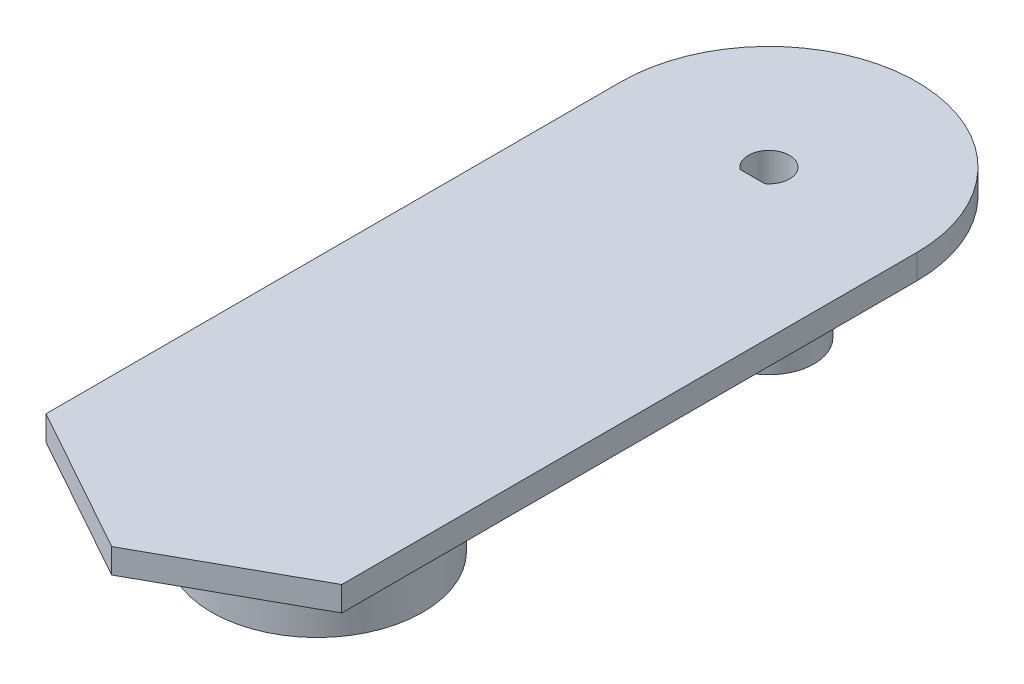
ISO-10303-21;
HEADER;
FILE_DESCRIPTION(('STEP AP214'),'2;1');
FILE_NAME('part.step','',(''),(''),'','','');
FILE_SCHEMA(('AUTOMOTIVE_DESIGN { 1 0 10303 214 1 1 1 1 }'));
ENDSEC;
DATA;
#1=APPLICATION_CONTEXT('core data for automotive mechanical design processes');
#2=APPLICATION_PROTOCOL_DEFINITION('international standard','automotive_design',2000,#1);
#3=PRODUCT_CONTEXT('',#1,'mechanical');
#4=PRODUCT('Part','Part','',(#3));
#5=PRODUCT_RELATED_PRODUCT_CATEGORY('part','',(#4));
#6=PRODUCT_DEFINITION_FORMATION('','',#4);
#7=PRODUCT_DEFINITION_CONTEXT('part definition',#1,'design');
#8=PRODUCT_DEFINITION('design','',#6,#7);
#9=PRODUCT_DEFINITION_SHAPE('','',#8);
#10=(LENGTH_UNIT() NAMED_UNIT(*) SI_UNIT(.MILLI.,.METRE.));
#11=(NAMED_UNIT(*) PLANE_ANGLE_UNIT() SI_UNIT($,.RADIAN.));
#12=(NAMED_UNIT(*) SI_UNIT($,.STERADIAN.) SOLID_ANGLE_UNIT());
#13=UNCERTAINTY_MEASURE_WITH_UNIT(LENGTH_MEASURE(1.E-05),#10,'distance_accuracy_value','');
#14=(GEOMETRIC_REPRESENTATION_CONTEXT(3) GLOBAL_UNCERTAINTY_ASSIGNED_CONTEXT((#13)) GLOBAL_UNIT_ASSIGNED_CONTEXT((#10,
#11,#12)) REPRESENTATION_CONTEXT('',''));
#15=CARTESIAN_POINT('',(0.,0.,0.));
#16=DIRECTION('',(0.,0.,1.));
#17=DIRECTION('',(1.,0.,0.));
#18=AXIS2_PLACEMENT_3D('',#15,#16,#17);
#19=CARTESIAN_POINT('',(2.5,15.,-2.5));
#20=DIRECTION('',(0.,-1.,0.));
#21=DIRECTION('',(0.,0.,-1.));
#22=AXIS2_PLACEMENT_3D('',#19,#20,#21);
#23=CYLINDRICAL_SURFACE('',#22,2.5);
#24=CARTESIAN_POINT('',(2.5,0.,-2.5));
#25=DIRECTION('',(0.,1.,0.));
#26=DIRECTION('',(0.,0.,1.));
#27=AXIS2_PLACEMENT_3D('',#24,#25,#26);
#28=CIRCLE('',#27,2.5);
#29=CARTESIAN_POINT('',(4.,0.,-0.5));
#30=VERTEX_POINT('',#29);
#31=CARTESIAN_POINT('',(0.999999999999999,0.,-0.5));
#32=VERTEX_POINT('',#31);
#33=EDGE_CURVE('E102',#30,#32,#28,.T.);
#34=ORIENTED_EDGE('',*,*,#33,.F.);
#35=DIRECTION('',(0.,-1.,0.));
#36=VECTOR('',#35,1.);
#37=CARTESIAN_POINT('',(4.,15.,-0.5));
#38=LINE('',#37,#36);
#39=CARTESIAN_POINT('',(4.,18.,-0.5));
#40=VERTEX_POINT('',#39);
#41=EDGE_CURVE('E42',#40,#30,#38,.T.);
#42=ORIENTED_EDGE('',*,*,#41,.F.);
#43=CARTESIAN_POINT('',(2.5,18.,-2.5));
#44=DIRECTION('',(0.,1.,0.));
#45=DIRECTION('',(0.,0.,1.));
#46=AXIS2_PLACEMENT_3D('',#43,#44,#45);
#47=CIRCLE('',#46,2.5);
#48=CARTESIAN_POINT('',(0.999999999999999,18.,-0.5));
#49=VERTEX_POINT('',#48);
#50=EDGE_CURVE('E134',#49,#40,#47,.F.);
#51=ORIENTED_EDGE('',*,*,#50,.F.);
#52=DIRECTION('',(0.,-1.,0.));
#53=VECTOR('',#52,1.);
#54=CARTESIAN_POINT('',(0.999999999999999,15.,-0.5));
#55=LINE('',#54,#53);
#56=EDGE_CURVE('E49',#49,#32,#55,.T.);
#57=ORIENTED_EDGE('',*,*,#56,.T.);
#58=EDGE_LOOP('',(#34,#42,#51,#57));
#59=FACE_BOUND('',#58,.T.);
#60=ADVANCED_FACE('F35',(#59),#23,.F.);
#61=CARTESIAN_POINT('',(0.,15.,-0.5));
#62=DIRECTION('',(0.,0.,-1.));
#63=DIRECTION('',(-1.,0.,0.));
#64=AXIS2_PLACEMENT_3D('',#61,#62,#63);
#65=PLANE('',#64);
#66=DIRECTION('',(1.,0.,0.));
#67=VECTOR('',#66,1.);
#68=CARTESIAN_POINT('',(0.,0.,-0.5));
#69=LINE('',#68,#67);
#70=EDGE_CURVE('E157',#32,#30,#69,.T.);
#71=ORIENTED_EDGE('',*,*,#70,.F.);
#72=ORIENTED_EDGE('',*,*,#56,.F.);
#73=DIRECTION('',(-1.,0.,0.));
#74=VECTOR('',#73,1.);
#75=CARTESIAN_POINT('',(0.,18.,-0.5));
#76=LINE('',#75,#74);
#77=EDGE_CURVE('E131',#40,#49,#76,.T.);
#78=ORIENTED_EDGE('',*,*,#77,.F.);
#79=ORIENTED_EDGE('',*,*,#41,.T.);
#80=EDGE_LOOP('',(#71,#72,#78,#79));
#81=FACE_BOUND('',#80,.T.);
#82=ADVANCED_FACE('F175',(#81),#65,.T.);
#83=CARTESIAN_POINT('',(2.5,15.,-2.5));
#84=DIRECTION('',(0.,-1.,0.));
#85=DIRECTION('',(0.,0.,-1.));
#86=AXIS2_PLACEMENT_3D('',#83,#84,#85);
#87=CYLINDRICAL_SURFACE('',#86,5.5);
#88=CARTESIAN_POINT('',(2.5,15.,-2.5));
#89=DIRECTION('',(0.,1.,0.));
#90=DIRECTION('',(0.,0.,1.));
#91=AXIS2_PLACEMENT_3D('',#88,#89,#90);
#92=CIRCLE('',#91,5.5);
#93=CARTESIAN_POINT('',(2.5,15.,3.));
#94=VERTEX_POINT('',#93);
#95=EDGE_CURVE('E152',#94,#94,#92,.T.);
#96=ORIENTED_EDGE('',*,*,#95,.F.);
#97=EDGE_LOOP('',(#96));
#98=FACE_BOUND('',#97,.T.);
#99=CARTESIAN_POINT('',(2.5,0.,-2.5));
#100=DIRECTION('',(0.,1.,0.));
#101=DIRECTION('',(0.,0.,1.));
#102=AXIS2_PLACEMENT_3D('',#99,#100,#101);
#103=CIRCLE('',#102,5.5);
#104=CARTESIAN_POINT('',(2.5,0.,3.));
#105=VERTEX_POINT('',#104);
#106=EDGE_CURVE('E155',#105,#105,#103,.T.);
#107=ORIENTED_EDGE('',*,*,#106,.T.);
#108=EDGE_LOOP('',(#107));
#109=FACE_BOUND('',#108,.T.);
#110=ADVANCED_FACE('F164',(#98,#109),#87,.T.);
#111=CARTESIAN_POINT('',(0.,0.,0.));
#112=DIRECTION('',(0.,1.,0.));
#113=DIRECTION('',(0.,0.,1.));
#114=AXIS2_PLACEMENT_3D('',#111,#112,#113);
#115=PLANE('',#114);
#116=ORIENTED_EDGE('',*,*,#33,.T.);
#117=ORIENTED_EDGE('',*,*,#70,.T.);
#118=EDGE_LOOP('',(#116,#117));
#119=FACE_BOUND('',#118,.T.);
#120=ORIENTED_EDGE('',*,*,#106,.F.);
#121=EDGE_LOOP('',(#120));
#122=FACE_BOUND('',#121,.T.);
#123=ADVANCED_FACE('F166',(#119,#122),#115,.F.);
#124=CARTESIAN_POINT('',(20.5,18.,0.));
#125=DIRECTION('',(1.,0.,0.));
#126=DIRECTION('',(0.,0.,-1.));
#127=AXIS2_PLACEMENT_3D('',#124,#125,#126);
#128=PLANE('',#127);
#129=DIRECTION('',(0.,0.,1.));
#130=VECTOR('',#129,1.);
#131=CARTESIAN_POINT('',(20.5,15.,0.));
#132=LINE('',#131,#130);
#133=CARTESIAN_POINT('',(20.5,15.,-2.5));
#134=VERTEX_POINT('',#133);
#135=CARTESIAN_POINT('',(20.5,15.,67.5));
#136=VERTEX_POINT('',#135);
#137=EDGE_CURVE('E99',#134,#136,#132,.T.);
#138=ORIENTED_EDGE('',*,*,#137,.F.);
#139=DIRECTION('',(0.,-1.,0.));
#140=VECTOR('',#139,1.);
#141=CARTESIAN_POINT('',(20.5,18.,-2.5));
#142=LINE('',#141,#140);
#143=CARTESIAN_POINT('',(20.5,18.,-2.5));
#144=VERTEX_POINT('',#143);
#145=EDGE_CURVE('E93',#144,#134,#142,.T.);
#146=ORIENTED_EDGE('',*,*,#145,.F.);
#147=DIRECTION('',(0.,0.,1.));
#148=VECTOR('',#147,1.);
#149=CARTESIAN_POINT('',(20.5,18.,0.));
#150=LINE('',#149,#148);
#151=CARTESIAN_POINT('',(20.5,18.,67.5));
#152=VERTEX_POINT('',#151);
#153=EDGE_CURVE('E97',#144,#152,#150,.T.);
#154=ORIENTED_EDGE('',*,*,#153,.T.);
#155=DIRECTION('',(0.,-1.,0.));
#156=VECTOR('',#155,1.);
#157=CARTESIAN_POINT('',(20.5,18.,67.5));
#158=LINE('',#157,#156);
#159=EDGE_CURVE('E137',#152,#136,#158,.T.);
#160=ORIENTED_EDGE('',*,*,#159,.T.);
#161=EDGE_LOOP('',(#138,#146,#154,#160));
#162=FACE_BOUND('',#161,.T.);
#163=ADVANCED_FACE('F95',(#162),#128,.T.);
#164=CARTESIAN_POINT('',(2.5,18.,-2.5));
#165=DIRECTION('',(0.,-1.,0.));
#166=DIRECTION('',(0.,0.,-1.));
#167=AXIS2_PLACEMENT_3D('',#164,#165,#166);
#168=CYLINDRICAL_SURFACE('',#167,18.);
#169=CARTESIAN_POINT('',(2.5,15.,-2.5));
#170=DIRECTION('',(0.,1.,0.));
#171=DIRECTION('',(0.,0.,1.));
#172=AXIS2_PLACEMENT_3D('',#169,#170,#171);
#173=CIRCLE('',#172,18.);
#174=CARTESIAN_POINT('',(-15.5,15.,-2.5));
#175=VERTEX_POINT('',#174);
#176=EDGE_CURVE('E139',#134,#175,#173,.T.);
#177=ORIENTED_EDGE('',*,*,#176,.T.);
#178=DIRECTION('',(0.,-1.,0.));
#179=VECTOR('',#178,1.);
#180=CARTESIAN_POINT('',(-15.5,18.,-2.5));
#181=LINE('',#180,#179);
#182=CARTESIAN_POINT('',(-15.5,18.,-2.5));
#183=VERTEX_POINT('',#182);
#184=EDGE_CURVE('E103',#183,#175,#181,.T.);
#185=ORIENTED_EDGE('',*,*,#184,.F.);
#186=CARTESIAN_POINT('',(2.5,18.,-2.5));
#187=DIRECTION('',(0.,1.,0.));
#188=DIRECTION('',(0.,0.,1.));
#189=AXIS2_PLACEMENT_3D('',#186,#187,#188);
#190=CIRCLE('',#189,18.);
#191=EDGE_CURVE('E106',#144,#183,#190,.T.);
#192=ORIENTED_EDGE('',*,*,#191,.F.);
#193=ORIENTED_EDGE('',*,*,#145,.T.);
#194=EDGE_LOOP('',(#177,#185,#192,#193));
#195=FACE_BOUND('',#194,.T.);
#196=ADVANCED_FACE('F107',(#195),#168,.T.);
#197=CARTESIAN_POINT('',(-15.5,18.,0.));
#198=DIRECTION('',(1.,0.,0.));
#199=DIRECTION('',(0.,0.,-1.));
#200=AXIS2_PLACEMENT_3D('',#197,#198,#199);
#201=PLANE('',#200);
#202=DIRECTION('',(0.,0.,1.));
#203=VECTOR('',#202,1.);
#204=CARTESIAN_POINT('',(-15.5,15.,0.));
#205=LINE('',#204,#203);
#206=CARTESIAN_POINT('',(-15.5,15.,67.5));
#207=VERTEX_POINT('',#206);
#208=EDGE_CURVE('E141',#175,#207,#205,.T.);
#209=ORIENTED_EDGE('',*,*,#208,.T.);
#210=DIRECTION('',(0.,-1.,0.));
#211=VECTOR('',#210,1.);
#212=CARTESIAN_POINT('',(-15.5,18.,67.5));
#213=LINE('',#212,#211);
#214=CARTESIAN_POINT('',(-15.5,18.,67.5));
#215=VERTEX_POINT('',#214);
#216=EDGE_CURVE('E148',#215,#207,#213,.T.);
#217=ORIENTED_EDGE('',*,*,#216,.F.);
#218=DIRECTION('',(0.,0.,1.));
#219=VECTOR('',#218,1.);
#220=CARTESIAN_POINT('',(-15.5,18.,0.));
#221=LINE('',#220,#219);
#222=EDGE_CURVE('E111',#183,#215,#221,.T.);
#223=ORIENTED_EDGE('',*,*,#222,.F.);
#224=ORIENTED_EDGE('',*,*,#184,.T.);
#225=EDGE_LOOP('',(#209,#217,#223,#224));
#226=FACE_BOUND('',#225,.T.);
#227=ADVANCED_FACE('F203',(#226),#201,.F.);
#228=CARTESIAN_POINT('',(-32.311320754717,18.,58.1603773584905));
#229=DIRECTION('',(0.485642931178632,0.,-0.874157276121537));
#230=DIRECTION('',(-0.874157276121538,0.,-0.485642931178632));
#231=AXIS2_PLACEMENT_3D('',#228,#229,#230);
#232=PLANE('',#231);
#233=DIRECTION('',(0.874157276121538,0.,0.485642931178632));
#234=VECTOR('',#233,1.);
#235=CARTESIAN_POINT('',(-32.311320754717,15.,58.1603773584905));
#236=LINE('',#235,#234);
#237=CARTESIAN_POINT('',(2.50000000000002,15.,77.5));
#238=VERTEX_POINT('',#237);
#239=EDGE_CURVE('E121',#207,#238,#236,.T.);
#240=ORIENTED_EDGE('',*,*,#239,.T.);
#241=DIRECTION('',(0.,-1.,0.));
#242=VECTOR('',#241,1.);
#243=CARTESIAN_POINT('',(2.50000000000002,18.,77.5));
#244=LINE('',#243,#242);
#245=CARTESIAN_POINT('',(2.50000000000002,18.,77.5));
#246=VERTEX_POINT('',#245);
#247=EDGE_CURVE('E145',#246,#238,#244,.T.);
#248=ORIENTED_EDGE('',*,*,#247,.F.);
#249=DIRECTION('',(0.874157276121538,0.,0.485642931178632));
#250=VECTOR('',#249,1.);
#251=CARTESIAN_POINT('',(-32.311320754717,18.,58.1603773584905));
#252=LINE('',#251,#250);
#253=EDGE_CURVE('E128',#215,#246,#252,.T.);
#254=ORIENTED_EDGE('',*,*,#253,.F.);
#255=ORIENTED_EDGE('',*,*,#216,.T.);
#256=EDGE_LOOP('',(#240,#248,#254,#255));
#257=FACE_BOUND('',#256,.T.);
#258=ADVANCED_FACE('F194',(#257),#232,.F.);
#259=CARTESIAN_POINT('',(33.4905660377359,18.,60.2830188679245));
#260=DIRECTION('',(-0.485642931178633,0.,-0.874157276121537));
#261=DIRECTION('',(-0.874157276121537,0.,0.485642931178633));
#262=AXIS2_PLACEMENT_3D('',#259,#260,#261);
#263=PLANE('',#262);
#264=DIRECTION('',(0.874157276121538,0.,-0.485642931178633));
#265=VECTOR('',#264,1.);
#266=CARTESIAN_POINT('',(33.4905660377359,15.,60.2830188679245));
#267=LINE('',#266,#265);
#268=EDGE_CURVE('E118',#238,#136,#267,.T.);
#269=ORIENTED_EDGE('',*,*,#268,.T.);
#270=ORIENTED_EDGE('',*,*,#159,.F.);
#271=DIRECTION('',(0.874157276121538,0.,-0.485642931178633));
#272=VECTOR('',#271,1.);
#273=CARTESIAN_POINT('',(33.4905660377359,18.,60.2830188679245));
#274=LINE('',#273,#272);
#275=EDGE_CURVE('E116',#246,#152,#274,.T.);
#276=ORIENTED_EDGE('',*,*,#275,.F.);
#277=ORIENTED_EDGE('',*,*,#247,.T.);
#278=EDGE_LOOP('',(#269,#270,#276,#277));
#279=FACE_BOUND('',#278,.T.);
#280=ADVANCED_FACE('F184',(#279),#263,.F.);
#281=CARTESIAN_POINT('',(0.,18.,0.));
#282=DIRECTION('',(0.,1.,0.));
#283=DIRECTION('',(0.,0.,1.));
#284=AXIS2_PLACEMENT_3D('',#281,#282,#283);
#285=PLANE('',#284);
#286=ORIENTED_EDGE('',*,*,#153,.F.);
#287=ORIENTED_EDGE('',*,*,#191,.T.);
#288=ORIENTED_EDGE('',*,*,#222,.T.);
#289=ORIENTED_EDGE('',*,*,#253,.T.);
#290=ORIENTED_EDGE('',*,*,#275,.T.);
#291=EDGE_LOOP('',(#286,#287,#288,#289,#290));
#292=FACE_BOUND('',#291,.T.);
#293=ORIENTED_EDGE('',*,*,#77,.T.);
#294=ORIENTED_EDGE('',*,*,#50,.T.);
#295=EDGE_LOOP('',(#293,#294));
#296=FACE_BOUND('',#295,.T.);
#297=ADVANCED_FACE('F113',(#292,#296),#285,.T.);
#298=CARTESIAN_POINT('',(0.,15.,0.));
#299=DIRECTION('',(0.,1.,0.));
#300=DIRECTION('',(0.,0.,1.));
#301=AXIS2_PLACEMENT_3D('',#298,#299,#300);
#302=PLANE('',#301);
#303=CARTESIAN_POINT('',(2.49999999999998,15.,52.5));
#304=DIRECTION('',(0.,1.,0.));
#305=DIRECTION('',(0.,0.,1.));
#306=AXIS2_PLACEMENT_3D('',#303,#304,#305);
#307=CIRCLE('',#306,12.86);
#308=CARTESIAN_POINT('',(2.49999999999998,15.,65.36));
#309=VERTEX_POINT('',#308);
#310=EDGE_CURVE('E11',#309,#309,#307,.F.);
#311=ORIENTED_EDGE('',*,*,#310,.F.);
#312=EDGE_LOOP('',(#311));
#313=FACE_BOUND('',#312,.T.);
#314=ORIENTED_EDGE('',*,*,#95,.T.);
#315=EDGE_LOOP('',(#314));
#316=FACE_BOUND('',#315,.T.);
#317=ORIENTED_EDGE('',*,*,#137,.T.);
#318=ORIENTED_EDGE('',*,*,#268,.F.);
#319=ORIENTED_EDGE('',*,*,#239,.F.);
#320=ORIENTED_EDGE('',*,*,#208,.F.);
#321=ORIENTED_EDGE('',*,*,#176,.F.);
#322=EDGE_LOOP('',(#317,#318,#319,#320,#321));
#323=FACE_BOUND('',#322,.T.);
#324=ADVANCED_FACE('F183',(#313,#316,#323),#302,.F.);
#325=CARTESIAN_POINT('',(2.49999999999998,5.,52.5));
#326=DIRECTION('',(0.,-1.,0.));
#327=DIRECTION('',(0.,0.,-1.));
#328=AXIS2_PLACEMENT_3D('',#325,#326,#327);
#329=PLANE('',#328);
#330=CARTESIAN_POINT('',(2.49999999999998,5.,52.5));
#331=DIRECTION('',(0.,-1.,0.));
#332=DIRECTION('',(0.,0.,-1.));
#333=AXIS2_PLACEMENT_3D('',#330,#331,#332);
#334=CIRCLE('',#333,12.86);
#335=CARTESIAN_POINT('',(2.49999999999998,5.,39.64));
#336=VERTEX_POINT('',#335);
#337=EDGE_CURVE('E124',#336,#336,#334,.T.);
#338=ORIENTED_EDGE('',*,*,#337,.T.);
#339=EDGE_LOOP('',(#338));
#340=FACE_BOUND('',#339,.T.);
#341=CARTESIAN_POINT('',(2.49999999999998,5.,52.5));
#342=DIRECTION('',(0.,-1.,0.));
#343=DIRECTION('',(0.,0.,-1.));
#344=AXIS2_PLACEMENT_3D('',#341,#342,#343);
#345=CIRCLE('',#344,9.86);
#346=CARTESIAN_POINT('',(2.49999999999998,5.,42.64));
#347=VERTEX_POINT('',#346);
#348=EDGE_CURVE('E287',#347,#347,#345,.T.);
#349=ORIENTED_EDGE('',*,*,#348,.F.);
#350=EDGE_LOOP('',(#349));
#351=FACE_BOUND('',#350,.T.);
#352=ADVANCED_FACE('F190',(#340,#351),#329,.T.);
#353=CARTESIAN_POINT('',(2.49999999999998,5.,52.5));
#354=DIRECTION('',(0.,1.,0.));
#355=DIRECTION('',(0.,0.,1.));
#356=AXIS2_PLACEMENT_3D('',#353,#354,#355);
#357=CYLINDRICAL_SURFACE('',#356,12.86);
#358=ORIENTED_EDGE('',*,*,#337,.F.);
#359=EDGE_LOOP('',(#358));
#360=FACE_BOUND('',#359,.T.);
#361=ORIENTED_EDGE('',*,*,#310,.T.);
#362=EDGE_LOOP('',(#361));
#363=FACE_BOUND('',#362,.T.);
#364=ADVANCED_FACE('F198',(#360,#363),#357,.T.);
#365=CARTESIAN_POINT('',(2.49999999999998,5.,52.5));
#366=DIRECTION('',(0.,1.,0.));
#367=DIRECTION('',(0.,0.,1.));
#368=AXIS2_PLACEMENT_3D('',#365,#366,#367);
#369=CYLINDRICAL_SURFACE('',#368,9.86);
#370=ORIENTED_EDGE('',*,*,#348,.T.);
#371=EDGE_LOOP('',(#370));
#372=FACE_BOUND('',#371,.T.);
#373=CARTESIAN_POINT('',(2.49999999999998,15.,52.5));
#374=DIRECTION('',(0.,-1.,0.));
#375=DIRECTION('',(0.,0.,-1.));
#376=AXIS2_PLACEMENT_3D('',#373,#374,#375);
#377=CIRCLE('',#376,9.86);
#378=CARTESIAN_POINT('',(2.49999999999998,15.,42.64));
#379=VERTEX_POINT('',#378);
#380=EDGE_CURVE('E285',#379,#379,#377,.T.);
#381=ORIENTED_EDGE('',*,*,#380,.F.);
#382=EDGE_LOOP('',(#381));
#383=FACE_BOUND('',#382,.T.);
#384=ADVANCED_FACE('F258',(#372,#383),#369,.F.);
#385=ORIENTED_EDGE('',*,*,#380,.T.);
#386=EDGE_LOOP('',(#385));
#387=FACE_BOUND('',#386,.T.);
#388=ADVANCED_FACE('F193',(#387),#302,.F.);
#389=CLOSED_SHELL('',(#60,#82,#110,#123,#163,#196,#227,#258,#280,#297,#324,#352,#364,#384,#388));
#390=MANIFOLD_SOLID_BREP('B2',#389);
#391=ADVANCED_BREP_SHAPE_REPRESENTATION('',(#18,#390),#14);
#392=SHAPE_DEFINITION_REPRESENTATION(#9,#391);
ENDSEC;
END-ISO-10303-21;
